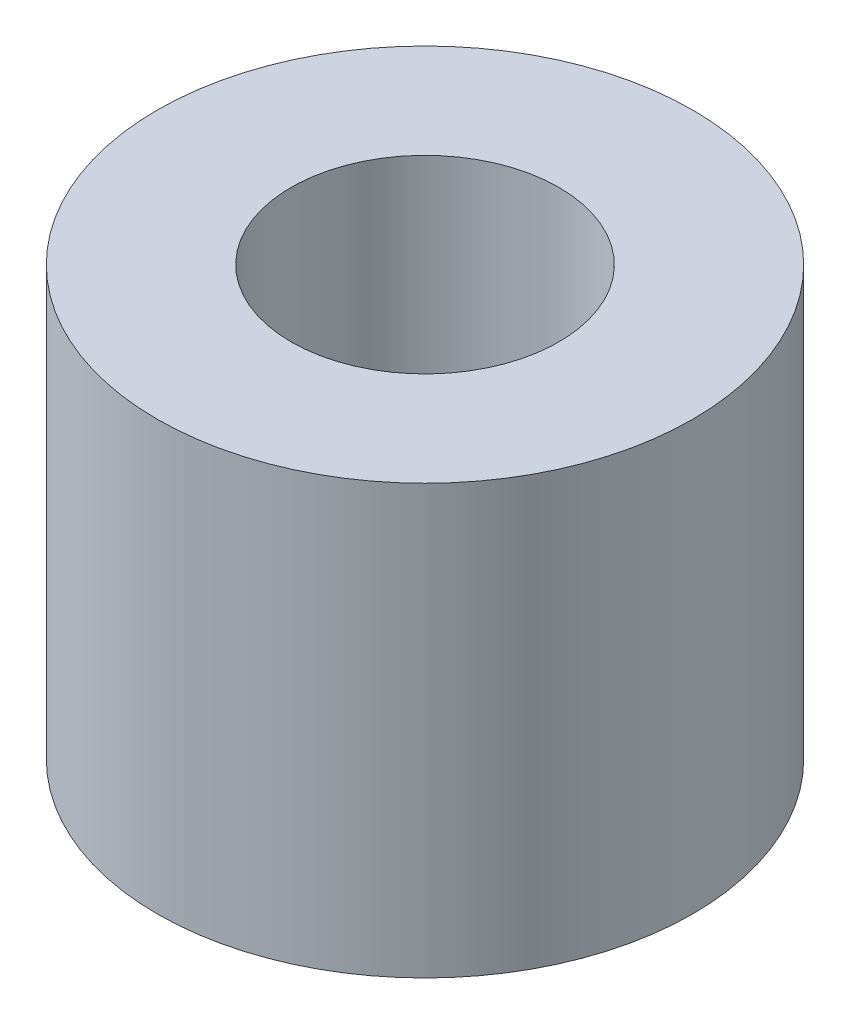
ISO-10303-21;
HEADER;
FILE_DESCRIPTION(('STEP AP214'),'2;1');
FILE_NAME('part.step','',(''),(''),'','','');
FILE_SCHEMA(('AUTOMOTIVE_DESIGN { 1 0 10303 214 1 1 1 1 }'));
ENDSEC;
DATA;
#1=APPLICATION_CONTEXT('core data for automotive mechanical design processes');
#2=APPLICATION_PROTOCOL_DEFINITION('international standard','automotive_design',2000,#1);
#3=PRODUCT_CONTEXT('',#1,'mechanical');
#4=PRODUCT('Part','Part','',(#3));
#5=PRODUCT_RELATED_PRODUCT_CATEGORY('part','',(#4));
#6=PRODUCT_DEFINITION_FORMATION('','',#4);
#7=PRODUCT_DEFINITION_CONTEXT('part definition',#1,'design');
#8=PRODUCT_DEFINITION('design','',#6,#7);
#9=PRODUCT_DEFINITION_SHAPE('','',#8);
#10=(LENGTH_UNIT() NAMED_UNIT(*) SI_UNIT(.MILLI.,.METRE.));
#11=(NAMED_UNIT(*) PLANE_ANGLE_UNIT() SI_UNIT($,.RADIAN.));
#12=(NAMED_UNIT(*) SI_UNIT($,.STERADIAN.) SOLID_ANGLE_UNIT());
#13=UNCERTAINTY_MEASURE_WITH_UNIT(LENGTH_MEASURE(1.E-05),#10,'distance_accuracy_value','');
#14=(GEOMETRIC_REPRESENTATION_CONTEXT(3) GLOBAL_UNCERTAINTY_ASSIGNED_CONTEXT((#13)) GLOBAL_UNIT_ASSIGNED_CONTEXT((#10,
#11,#12)) REPRESENTATION_CONTEXT('',''));
#15=CARTESIAN_POINT('',(0.,0.,0.));
#16=DIRECTION('',(0.,0.,1.));
#17=DIRECTION('',(1.,0.,0.));
#18=AXIS2_PLACEMENT_3D('',#15,#16,#17);
#19=CARTESIAN_POINT('',(0.,10.16,0.));
#20=DIRECTION('',(0.,1.,0.));
#21=DIRECTION('',(0.,0.,1.));
#22=AXIS2_PLACEMENT_3D('',#19,#20,#21);
#23=PLANE('',#22);
#24=CARTESIAN_POINT('',(0.,10.16,0.));
#25=DIRECTION('',(0.,1.,0.));
#26=DIRECTION('',(0.,0.,1.));
#27=AXIS2_PLACEMENT_3D('',#24,#25,#26);
#28=CIRCLE('',#27,6.35);
#29=CARTESIAN_POINT('',(0.,10.16,6.35));
#30=VERTEX_POINT('',#29);
#31=EDGE_CURVE('E10',#30,#30,#28,.T.);
#32=ORIENTED_EDGE('',*,*,#31,.T.);
#33=EDGE_LOOP('',(#32));
#34=FACE_BOUND('',#33,.T.);
#35=CARTESIAN_POINT('',(0.,10.16,0.));
#36=DIRECTION('',(0.,1.,0.));
#37=DIRECTION('',(0.,0.,1.));
#38=AXIS2_PLACEMENT_3D('',#35,#36,#37);
#39=CIRCLE('',#38,3.175);
#40=CARTESIAN_POINT('',(0.,10.16,3.175));
#41=VERTEX_POINT('',#40);
#42=EDGE_CURVE('E50',#41,#41,#39,.T.);
#43=ORIENTED_EDGE('',*,*,#42,.F.);
#44=EDGE_LOOP('',(#43));
#45=FACE_BOUND('',#44,.T.);
#46=ADVANCED_FACE('F37',(#34,#45),#23,.T.);
#47=CARTESIAN_POINT('',(0.,0.,0.));
#48=DIRECTION('',(0.,1.,0.));
#49=DIRECTION('',(0.,0.,1.));
#50=AXIS2_PLACEMENT_3D('',#47,#48,#49);
#51=PLANE('',#50);
#52=CARTESIAN_POINT('',(0.,0.,0.));
#53=DIRECTION('',(0.,1.,0.));
#54=DIRECTION('',(0.,0.,1.));
#55=AXIS2_PLACEMENT_3D('',#52,#53,#54);
#56=CIRCLE('',#55,6.35);
#57=CARTESIAN_POINT('',(0.,0.,6.35));
#58=VERTEX_POINT('',#57);
#59=EDGE_CURVE('E41',#58,#58,#56,.T.);
#60=ORIENTED_EDGE('',*,*,#59,.F.);
#61=EDGE_LOOP('',(#60));
#62=FACE_BOUND('',#61,.T.);
#63=CARTESIAN_POINT('',(0.,0.,0.));
#64=DIRECTION('',(0.,1.,0.));
#65=DIRECTION('',(0.,0.,1.));
#66=AXIS2_PLACEMENT_3D('',#63,#64,#65);
#67=CIRCLE('',#66,3.175);
#68=CARTESIAN_POINT('',(0.,0.,3.175));
#69=VERTEX_POINT('',#68);
#70=EDGE_CURVE('E52',#69,#69,#67,.T.);
#71=ORIENTED_EDGE('',*,*,#70,.T.);
#72=EDGE_LOOP('',(#71));
#73=FACE_BOUND('',#72,.T.);
#74=ADVANCED_FACE('F64',(#62,#73),#51,.F.);
#75=CARTESIAN_POINT('',(0.,10.16,0.));
#76=DIRECTION('',(0.,-1.,0.));
#77=DIRECTION('',(0.,0.,-1.));
#78=AXIS2_PLACEMENT_3D('',#75,#76,#77);
#79=CYLINDRICAL_SURFACE('',#78,6.35);
#80=ORIENTED_EDGE('',*,*,#31,.F.);
#81=EDGE_LOOP('',(#80));
#82=FACE_BOUND('',#81,.T.);
#83=ORIENTED_EDGE('',*,*,#59,.T.);
#84=EDGE_LOOP('',(#83));
#85=FACE_BOUND('',#84,.T.);
#86=ADVANCED_FACE('F39',(#82,#85),#79,.T.);
#87=CARTESIAN_POINT('',(0.,10.16,0.));
#88=DIRECTION('',(0.,-1.,0.));
#89=DIRECTION('',(0.,0.,-1.));
#90=AXIS2_PLACEMENT_3D('',#87,#88,#89);
#91=CYLINDRICAL_SURFACE('',#90,3.175);
#92=ORIENTED_EDGE('',*,*,#42,.T.);
#93=EDGE_LOOP('',(#92));
#94=FACE_BOUND('',#93,.T.);
#95=ORIENTED_EDGE('',*,*,#70,.F.);
#96=EDGE_LOOP('',(#95));
#97=FACE_BOUND('',#96,.T.);
#98=ADVANCED_FACE('F60',(#94,#97),#91,.F.);
#99=CLOSED_SHELL('',(#46,#74,#86,#98));
#100=MANIFOLD_SOLID_BREP('B2',#99);
#101=ADVANCED_BREP_SHAPE_REPRESENTATION('',(#18,#100),#14);
#102=SHAPE_DEFINITION_REPRESENTATION(#9,#101);
ENDSEC;
END-ISO-10303-21;
